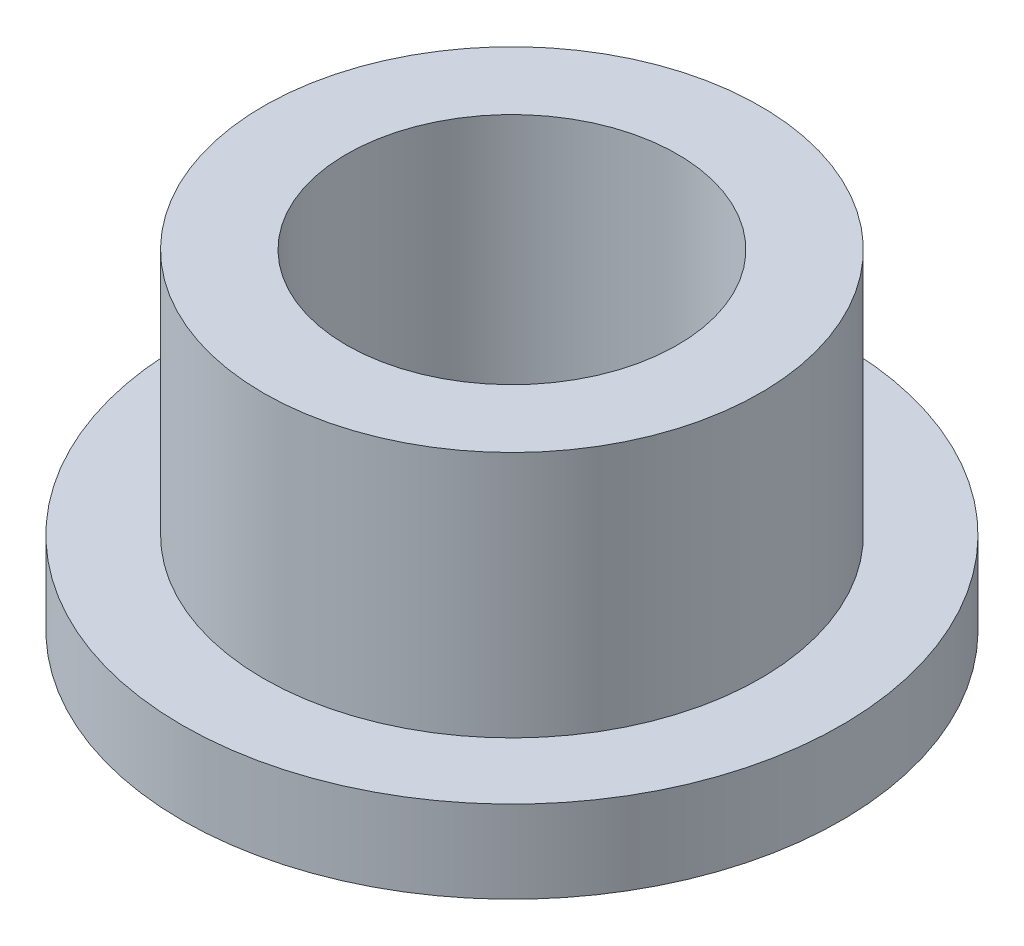
ISO-10303-21;
HEADER;
FILE_DESCRIPTION(('STEP AP214'),'2;1');
FILE_NAME('part.step','',(''),(''),'','','');
FILE_SCHEMA(('AUTOMOTIVE_DESIGN { 1 0 10303 214 1 1 1 1 }'));
ENDSEC;
DATA;
#1=APPLICATION_CONTEXT('core data for automotive mechanical design processes');
#2=APPLICATION_PROTOCOL_DEFINITION('international standard','automotive_design',2000,#1);
#3=PRODUCT_CONTEXT('',#1,'mechanical');
#4=PRODUCT('Part','Part','',(#3));
#5=PRODUCT_RELATED_PRODUCT_CATEGORY('part','',(#4));
#6=PRODUCT_DEFINITION_FORMATION('','',#4);
#7=PRODUCT_DEFINITION_CONTEXT('part definition',#1,'design');
#8=PRODUCT_DEFINITION('design','',#6,#7);
#9=PRODUCT_DEFINITION_SHAPE('','',#8);
#10=(LENGTH_UNIT() NAMED_UNIT(*) SI_UNIT(.MILLI.,.METRE.));
#11=(NAMED_UNIT(*) PLANE_ANGLE_UNIT() SI_UNIT($,.RADIAN.));
#12=(NAMED_UNIT(*) SI_UNIT($,.STERADIAN.) SOLID_ANGLE_UNIT());
#13=UNCERTAINTY_MEASURE_WITH_UNIT(LENGTH_MEASURE(1.E-05),#10,'distance_accuracy_value','');
#14=(GEOMETRIC_REPRESENTATION_CONTEXT(3) GLOBAL_UNCERTAINTY_ASSIGNED_CONTEXT((#13)) GLOBAL_UNIT_ASSIGNED_CONTEXT((#10,
#11,#12)) REPRESENTATION_CONTEXT('',''));
#15=CARTESIAN_POINT('',(0.,0.,0.));
#16=DIRECTION('',(0.,0.,1.));
#17=DIRECTION('',(1.,0.,0.));
#18=AXIS2_PLACEMENT_3D('',#15,#16,#17);
#19=CARTESIAN_POINT('',(0.,6.35,0.));
#20=DIRECTION('',(0.,1.,0.));
#21=DIRECTION('',(0.,0.,1.));
#22=AXIS2_PLACEMENT_3D('',#19,#20,#21);
#23=PLANE('',#22);
#24=CARTESIAN_POINT('',(0.,6.35,0.));
#25=DIRECTION('',(0.,1.,0.));
#26=DIRECTION('',(0.,0.,1.));
#27=AXIS2_PLACEMENT_3D('',#24,#25,#26);
#28=CIRCLE('',#27,4.7879);
#29=CARTESIAN_POINT('',(0.,6.35,4.7879));
#30=VERTEX_POINT('',#29);
#31=EDGE_CURVE('E10',#30,#30,#28,.T.);
#32=ORIENTED_EDGE('',*,*,#31,.T.);
#33=EDGE_LOOP('',(#32));
#34=FACE_BOUND('',#33,.T.);
#35=CARTESIAN_POINT('',(0.,6.35,0.));
#36=DIRECTION('',(0.,1.,0.));
#37=DIRECTION('',(0.,0.,1.));
#38=AXIS2_PLACEMENT_3D('',#35,#36,#37);
#39=CIRCLE('',#38,3.1877);
#40=CARTESIAN_POINT('',(0.,6.35,3.1877));
#41=VERTEX_POINT('',#40);
#42=EDGE_CURVE('E37',#41,#41,#39,.T.);
#43=ORIENTED_EDGE('',*,*,#42,.F.);
#44=EDGE_LOOP('',(#43));
#45=FACE_BOUND('',#44,.T.);
#46=ADVANCED_FACE('F30',(#34,#45),#23,.T.);
#47=CARTESIAN_POINT('',(0.,0.,0.));
#48=DIRECTION('',(0.,1.,0.));
#49=DIRECTION('',(0.,0.,1.));
#50=AXIS2_PLACEMENT_3D('',#47,#48,#49);
#51=PLANE('',#50);
#52=CARTESIAN_POINT('',(0.,0.,0.));
#53=DIRECTION('',(0.,1.,0.));
#54=DIRECTION('',(0.,0.,1.));
#55=AXIS2_PLACEMENT_3D('',#52,#53,#54);
#56=CIRCLE('',#55,3.1877);
#57=CARTESIAN_POINT('',(0.,0.,3.1877));
#58=VERTEX_POINT('',#57);
#59=EDGE_CURVE('E41',#58,#58,#56,.T.);
#60=ORIENTED_EDGE('',*,*,#59,.T.);
#61=EDGE_LOOP('',(#60));
#62=FACE_BOUND('',#61,.T.);
#63=CARTESIAN_POINT('',(0.,0.,0.));
#64=DIRECTION('',(0.,1.,0.));
#65=DIRECTION('',(0.,0.,1.));
#66=AXIS2_PLACEMENT_3D('',#63,#64,#65);
#67=CIRCLE('',#66,6.35);
#68=CARTESIAN_POINT('',(0.,0.,6.35));
#69=VERTEX_POINT('',#68);
#70=EDGE_CURVE('E48',#69,#69,#67,.T.);
#71=ORIENTED_EDGE('',*,*,#70,.F.);
#72=EDGE_LOOP('',(#71));
#73=FACE_BOUND('',#72,.T.);
#74=ADVANCED_FACE('F73',(#62,#73),#51,.F.);
#75=CARTESIAN_POINT('',(0.,6.35,0.));
#76=DIRECTION('',(0.,-1.,0.));
#77=DIRECTION('',(0.,0.,-1.));
#78=AXIS2_PLACEMENT_3D('',#75,#76,#77);
#79=CYLINDRICAL_SURFACE('',#78,4.7879);
#80=CARTESIAN_POINT('',(0.,1.5875,0.));
#81=DIRECTION('',(0.,1.,0.));
#82=DIRECTION('',(0.,0.,1.));
#83=AXIS2_PLACEMENT_3D('',#80,#81,#82);
#84=CIRCLE('',#83,4.7879);
#85=CARTESIAN_POINT('',(0.,1.5875,4.7879));
#86=VERTEX_POINT('',#85);
#87=EDGE_CURVE('E51',#86,#86,#84,.T.);
#88=ORIENTED_EDGE('',*,*,#87,.T.);
#89=EDGE_LOOP('',(#88));
#90=FACE_BOUND('',#89,.T.);
#91=ORIENTED_EDGE('',*,*,#31,.F.);
#92=EDGE_LOOP('',(#91));
#93=FACE_BOUND('',#92,.T.);
#94=ADVANCED_FACE('F32',(#90,#93),#79,.T.);
#95=CARTESIAN_POINT('',(0.,6.35,0.));
#96=DIRECTION('',(0.,-1.,0.));
#97=DIRECTION('',(0.,0.,-1.));
#98=AXIS2_PLACEMENT_3D('',#95,#96,#97);
#99=CYLINDRICAL_SURFACE('',#98,3.1877);
#100=ORIENTED_EDGE('',*,*,#42,.T.);
#101=EDGE_LOOP('',(#100));
#102=FACE_BOUND('',#101,.T.);
#103=ORIENTED_EDGE('',*,*,#59,.F.);
#104=EDGE_LOOP('',(#103));
#105=FACE_BOUND('',#104,.T.);
#106=ADVANCED_FACE('F62',(#102,#105),#99,.F.);
#107=CARTESIAN_POINT('',(0.,1.5875,0.));
#108=DIRECTION('',(0.,1.,0.));
#109=DIRECTION('',(0.,0.,1.));
#110=AXIS2_PLACEMENT_3D('',#107,#108,#109);
#111=PLANE('',#110);
#112=CARTESIAN_POINT('',(0.,1.5875,0.));
#113=DIRECTION('',(0.,1.,0.));
#114=DIRECTION('',(0.,0.,1.));
#115=AXIS2_PLACEMENT_3D('',#112,#113,#114);
#116=CIRCLE('',#115,6.35);
#117=CARTESIAN_POINT('',(0.,1.5875,6.35));
#118=VERTEX_POINT('',#117);
#119=EDGE_CURVE('E46',#118,#118,#116,.T.);
#120=ORIENTED_EDGE('',*,*,#119,.T.);
#121=EDGE_LOOP('',(#120));
#122=FACE_BOUND('',#121,.T.);
#123=ORIENTED_EDGE('',*,*,#87,.F.);
#124=EDGE_LOOP('',(#123));
#125=FACE_BOUND('',#124,.T.);
#126=ADVANCED_FACE('F59',(#122,#125),#111,.T.);
#127=CARTESIAN_POINT('',(0.,1.5875,0.));
#128=DIRECTION('',(0.,-1.,0.));
#129=DIRECTION('',(0.,0.,-1.));
#130=AXIS2_PLACEMENT_3D('',#127,#128,#129);
#131=CYLINDRICAL_SURFACE('',#130,6.35);
#132=ORIENTED_EDGE('',*,*,#119,.F.);
#133=EDGE_LOOP('',(#132));
#134=FACE_BOUND('',#133,.T.);
#135=ORIENTED_EDGE('',*,*,#70,.T.);
#136=EDGE_LOOP('',(#135));
#137=FACE_BOUND('',#136,.T.);
#138=ADVANCED_FACE('F61',(#134,#137),#131,.T.);
#139=CLOSED_SHELL('',(#46,#74,#94,#106,#126,#138));
#140=MANIFOLD_SOLID_BREP('B2',#139);
#141=ADVANCED_BREP_SHAPE_REPRESENTATION('',(#18,#140),#14);
#142=SHAPE_DEFINITION_REPRESENTATION(#9,#141);
ENDSEC;
END-ISO-10303-21;
